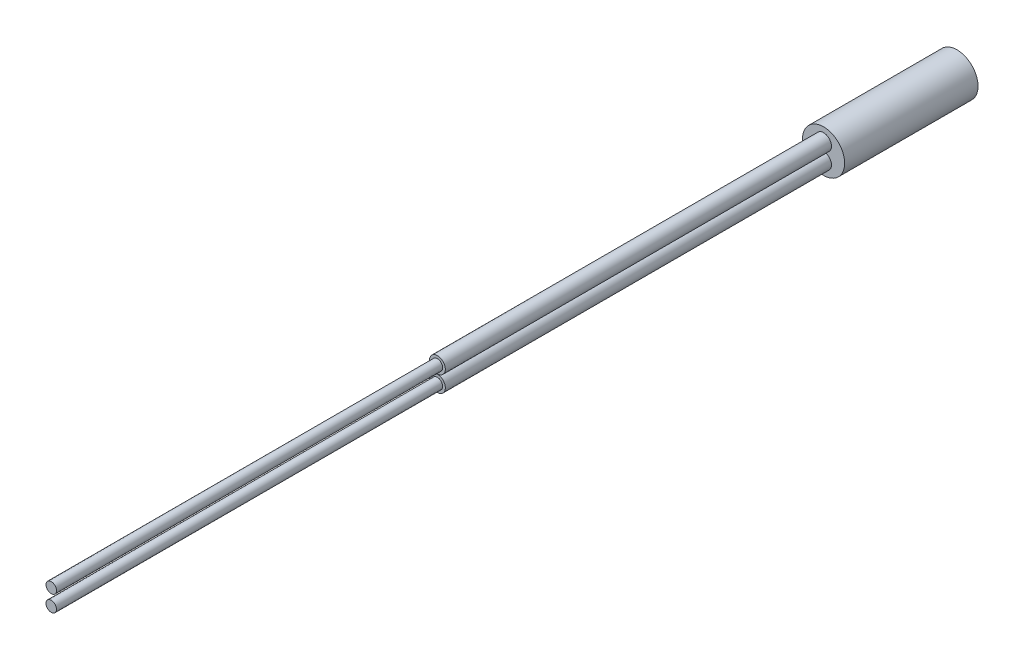
ISO-10303-21;
HEADER;
FILE_DESCRIPTION(('STEP AP214'),'2;1');
FILE_NAME('part.step','',(''),(''),'','','');
FILE_SCHEMA(('AUTOMOTIVE_DESIGN { 1 0 10303 214 1 1 1 1 }'));
ENDSEC;
DATA;
#1=APPLICATION_CONTEXT('core data for automotive mechanical design processes');
#2=APPLICATION_PROTOCOL_DEFINITION('international standard','automotive_design',2000,#1);
#3=PRODUCT_CONTEXT('',#1,'mechanical');
#4=PRODUCT('Part','Part','',(#3));
#5=PRODUCT_RELATED_PRODUCT_CATEGORY('part','',(#4));
#6=PRODUCT_DEFINITION_FORMATION('','',#4);
#7=PRODUCT_DEFINITION_CONTEXT('part definition',#1,'design');
#8=PRODUCT_DEFINITION('design','',#6,#7);
#9=PRODUCT_DEFINITION_SHAPE('','',#8);
#10=(LENGTH_UNIT() NAMED_UNIT(*) SI_UNIT(.MILLI.,.METRE.));
#11=(NAMED_UNIT(*) PLANE_ANGLE_UNIT() SI_UNIT($,.RADIAN.));
#12=(NAMED_UNIT(*) SI_UNIT($,.STERADIAN.) SOLID_ANGLE_UNIT());
#13=UNCERTAINTY_MEASURE_WITH_UNIT(LENGTH_MEASURE(1.E-05),#10,'distance_accuracy_value','');
#14=(GEOMETRIC_REPRESENTATION_CONTEXT(3) GLOBAL_UNCERTAINTY_ASSIGNED_CONTEXT((#13)) GLOBAL_UNIT_ASSIGNED_CONTEXT((#10,
#11,#12)) REPRESENTATION_CONTEXT('',''));
#15=CARTESIAN_POINT('',(0.,0.,0.));
#16=DIRECTION('',(0.,0.,1.));
#17=DIRECTION('',(1.,0.,0.));
#18=AXIS2_PLACEMENT_3D('',#15,#16,#17);
#19=CARTESIAN_POINT('',(0.,1.15,76.5));
#20=DIRECTION('',(0.,0.,1.));
#21=DIRECTION('',(1.,0.,0.));
#22=AXIS2_PLACEMENT_3D('',#19,#20,#21);
#23=PLANE('',#22);
#24=CARTESIAN_POINT('',(0.,1.15,76.5));
#25=DIRECTION('',(0.,0.,1.));
#26=DIRECTION('',(1.,0.,0.));
#27=AXIS2_PLACEMENT_3D('',#24,#25,#26);
#28=CIRCLE('',#27,1.125);
#29=CARTESIAN_POINT('',(1.125,1.15,76.5));
#30=VERTEX_POINT('',#29);
#31=EDGE_CURVE('E55',#30,#30,#28,.T.);
#32=ORIENTED_EDGE('',*,*,#31,.T.);
#33=EDGE_LOOP('',(#32));
#34=FACE_BOUND('',#33,.T.);
#35=CARTESIAN_POINT('',(0.,1.15,76.5));
#36=DIRECTION('',(0.,0.,1.));
#37=DIRECTION('',(1.,0.,0.));
#38=AXIS2_PLACEMENT_3D('',#35,#36,#37);
#39=CIRCLE('',#38,0.75);
#40=CARTESIAN_POINT('',(0.75,1.15,76.5));
#41=VERTEX_POINT('',#40);
#42=EDGE_CURVE('E36',#41,#41,#39,.F.);
#43=ORIENTED_EDGE('',*,*,#42,.T.);
#44=EDGE_LOOP('',(#43));
#45=FACE_BOUND('',#44,.T.);
#46=ADVANCED_FACE('F32',(#34,#45),#23,.T.);
#47=CARTESIAN_POINT('',(0.,-1.15,76.5));
#48=DIRECTION('',(0.,0.,1.));
#49=DIRECTION('',(1.,0.,0.));
#50=AXIS2_PLACEMENT_3D('',#47,#48,#49);
#51=PLANE('',#50);
#52=CARTESIAN_POINT('',(0.,-1.15,76.5));
#53=DIRECTION('',(0.,0.,1.));
#54=DIRECTION('',(1.,0.,0.));
#55=AXIS2_PLACEMENT_3D('',#52,#53,#54);
#56=CIRCLE('',#55,1.125);
#57=CARTESIAN_POINT('',(1.125,-1.15,76.5));
#58=VERTEX_POINT('',#57);
#59=EDGE_CURVE('E45',#58,#58,#56,.T.);
#60=ORIENTED_EDGE('',*,*,#59,.T.);
#61=EDGE_LOOP('',(#60));
#62=FACE_BOUND('',#61,.T.);
#63=CARTESIAN_POINT('',(0.,-1.15,76.5));
#64=DIRECTION('',(0.,0.,1.));
#65=DIRECTION('',(1.,0.,0.));
#66=AXIS2_PLACEMENT_3D('',#63,#64,#65);
#67=CIRCLE('',#66,0.75);
#68=CARTESIAN_POINT('',(0.75,-1.15,76.5));
#69=VERTEX_POINT('',#68);
#70=EDGE_CURVE('E48',#69,#69,#67,.F.);
#71=ORIENTED_EDGE('',*,*,#70,.T.);
#72=EDGE_LOOP('',(#71));
#73=FACE_BOUND('',#72,.T.);
#74=ADVANCED_FACE('F76',(#62,#73),#51,.T.);
#75=CARTESIAN_POINT('',(0.,0.,21.5));
#76=DIRECTION('',(0.,0.,1.));
#77=DIRECTION('',(1.,0.,0.));
#78=AXIS2_PLACEMENT_3D('',#75,#76,#77);
#79=PLANE('',#78);
#80=CARTESIAN_POINT('',(0.,-1.15,21.5));
#81=DIRECTION('',(0.,0.,1.));
#82=DIRECTION('',(1.,0.,0.));
#83=AXIS2_PLACEMENT_3D('',#80,#81,#82);
#84=CIRCLE('',#83,1.125);
#85=CARTESIAN_POINT('',(1.125,-1.15,21.5));
#86=VERTEX_POINT('',#85);
#87=EDGE_CURVE('E66',#86,#86,#84,.T.);
#88=ORIENTED_EDGE('',*,*,#87,.F.);
#89=EDGE_LOOP('',(#88));
#90=FACE_BOUND('',#89,.T.);
#91=CARTESIAN_POINT('',(0.,0.,21.5));
#92=DIRECTION('',(0.,0.,1.));
#93=DIRECTION('',(1.,0.,0.));
#94=AXIS2_PLACEMENT_3D('',#91,#92,#93);
#95=CIRCLE('',#94,3.);
#96=CARTESIAN_POINT('',(3.,0.,21.5));
#97=VERTEX_POINT('',#96);
#98=EDGE_CURVE('E10',#97,#97,#95,.T.);
#99=ORIENTED_EDGE('',*,*,#98,.T.);
#100=EDGE_LOOP('',(#99));
#101=FACE_BOUND('',#100,.T.);
#102=CARTESIAN_POINT('',(0.,1.15,21.5));
#103=DIRECTION('',(0.,0.,1.));
#104=DIRECTION('',(1.,0.,0.));
#105=AXIS2_PLACEMENT_3D('',#102,#103,#104);
#106=CIRCLE('',#105,1.125);
#107=CARTESIAN_POINT('',(1.125,1.15,21.5));
#108=VERTEX_POINT('',#107);
#109=EDGE_CURVE('E50',#108,#108,#106,.T.);
#110=ORIENTED_EDGE('',*,*,#109,.F.);
#111=EDGE_LOOP('',(#110));
#112=FACE_BOUND('',#111,.T.);
#113=ADVANCED_FACE('F74',(#90,#101,#112),#79,.T.);
#114=CARTESIAN_POINT('',(0.,0.,18.));
#115=DIRECTION('',(0.,0.,-1.));
#116=DIRECTION('',(-1.,0.,0.));
#117=AXIS2_PLACEMENT_3D('',#114,#115,#116);
#118=CYLINDRICAL_SURFACE('',#117,3.);
#119=ORIENTED_EDGE('',*,*,#98,.F.);
#120=EDGE_LOOP('',(#119));
#121=FACE_BOUND('',#120,.T.);
#122=CARTESIAN_POINT('',(0.,0.,2.5));
#123=DIRECTION('',(0.,0.,-1.));
#124=DIRECTION('',(-1.,0.,0.));
#125=AXIS2_PLACEMENT_3D('',#122,#123,#124);
#126=CIRCLE('',#125,3.);
#127=CARTESIAN_POINT('',(-3.,0.,2.5));
#128=VERTEX_POINT('',#127);
#129=EDGE_CURVE('E40',#128,#128,#126,.T.);
#130=ORIENTED_EDGE('',*,*,#129,.F.);
#131=EDGE_LOOP('',(#130));
#132=FACE_BOUND('',#131,.T.);
#133=ADVANCED_FACE('F34',(#121,#132),#118,.T.);
#134=CARTESIAN_POINT('',(0.,0.,2.5));
#135=DIRECTION('',(0.,0.,-1.));
#136=DIRECTION('',(-1.,0.,0.));
#137=AXIS2_PLACEMENT_3D('',#134,#135,#136);
#138=PLANE('',#137);
#139=ORIENTED_EDGE('',*,*,#129,.T.);
#140=EDGE_LOOP('',(#139));
#141=FACE_BOUND('',#140,.T.);
#142=ADVANCED_FACE('F92',(#141),#138,.T.);
#143=CARTESIAN_POINT('',(0.,-1.15,76.5));
#144=DIRECTION('',(0.,0.,-1.));
#145=DIRECTION('',(-1.,0.,0.));
#146=AXIS2_PLACEMENT_3D('',#143,#144,#145);
#147=CYLINDRICAL_SURFACE('',#146,1.125);
#148=ORIENTED_EDGE('',*,*,#59,.F.);
#149=EDGE_LOOP('',(#148));
#150=FACE_BOUND('',#149,.T.);
#151=ORIENTED_EDGE('',*,*,#87,.T.);
#152=EDGE_LOOP('',(#151));
#153=FACE_BOUND('',#152,.T.);
#154=ADVANCED_FACE('F72',(#150,#153),#147,.T.);
#155=CARTESIAN_POINT('',(0.,1.15,76.5));
#156=DIRECTION('',(0.,0.,-1.));
#157=DIRECTION('',(-1.,0.,0.));
#158=AXIS2_PLACEMENT_3D('',#155,#156,#157);
#159=CYLINDRICAL_SURFACE('',#158,1.125);
#160=ORIENTED_EDGE('',*,*,#31,.F.);
#161=EDGE_LOOP('',(#160));
#162=FACE_BOUND('',#161,.T.);
#163=ORIENTED_EDGE('',*,*,#109,.T.);
#164=EDGE_LOOP('',(#163));
#165=FACE_BOUND('',#164,.T.);
#166=ADVANCED_FACE('F80',(#162,#165),#159,.T.);
#167=CARTESIAN_POINT('',(0.,-1.15,131.5));
#168=DIRECTION('',(0.,0.,-1.));
#169=DIRECTION('',(-1.,0.,0.));
#170=AXIS2_PLACEMENT_3D('',#167,#168,#169);
#171=CYLINDRICAL_SURFACE('',#170,0.75);
#172=ORIENTED_EDGE('',*,*,#70,.F.);
#173=EDGE_LOOP('',(#172));
#174=FACE_BOUND('',#173,.T.);
#175=CARTESIAN_POINT('',(0.,-1.15,131.5));
#176=DIRECTION('',(0.,0.,1.));
#177=DIRECTION('',(1.,0.,0.));
#178=AXIS2_PLACEMENT_3D('',#175,#176,#177);
#179=CIRCLE('',#178,0.75);
#180=CARTESIAN_POINT('',(0.75,-1.15,131.5));
#181=VERTEX_POINT('',#180);
#182=EDGE_CURVE('E51',#181,#181,#179,.T.);
#183=ORIENTED_EDGE('',*,*,#182,.F.);
#184=EDGE_LOOP('',(#183));
#185=FACE_BOUND('',#184,.T.);
#186=ADVANCED_FACE('F82',(#174,#185),#171,.T.);
#187=CARTESIAN_POINT('',(0.,-1.15,131.5));
#188=DIRECTION('',(0.,0.,1.));
#189=DIRECTION('',(1.,0.,0.));
#190=AXIS2_PLACEMENT_3D('',#187,#188,#189);
#191=PLANE('',#190);
#192=ORIENTED_EDGE('',*,*,#182,.T.);
#193=EDGE_LOOP('',(#192));
#194=FACE_BOUND('',#193,.T.);
#195=ADVANCED_FACE('F89',(#194),#191,.T.);
#196=CARTESIAN_POINT('',(0.,1.15,131.5));
#197=DIRECTION('',(0.,0.,-1.));
#198=DIRECTION('',(-1.,0.,0.));
#199=AXIS2_PLACEMENT_3D('',#196,#197,#198);
#200=CYLINDRICAL_SURFACE('',#199,0.75);
#201=ORIENTED_EDGE('',*,*,#42,.F.);
#202=EDGE_LOOP('',(#201));
#203=FACE_BOUND('',#202,.T.);
#204=CARTESIAN_POINT('',(0.,1.15,131.5));
#205=DIRECTION('',(0.,0.,1.));
#206=DIRECTION('',(1.,0.,0.));
#207=AXIS2_PLACEMENT_3D('',#204,#205,#206);
#208=CIRCLE('',#207,0.75);
#209=CARTESIAN_POINT('',(0.75,1.15,131.5));
#210=VERTEX_POINT('',#209);
#211=EDGE_CURVE('E62',#210,#210,#208,.T.);
#212=ORIENTED_EDGE('',*,*,#211,.F.);
#213=EDGE_LOOP('',(#212));
#214=FACE_BOUND('',#213,.T.);
#215=ADVANCED_FACE('F108',(#203,#214),#200,.T.);
#216=CARTESIAN_POINT('',(0.,1.15,131.5));
#217=DIRECTION('',(0.,0.,1.));
#218=DIRECTION('',(1.,0.,0.));
#219=AXIS2_PLACEMENT_3D('',#216,#217,#218);
#220=PLANE('',#219);
#221=ORIENTED_EDGE('',*,*,#211,.T.);
#222=EDGE_LOOP('',(#221));
#223=FACE_BOUND('',#222,.T.);
#224=ADVANCED_FACE('F111',(#223),#220,.T.);
#225=CLOSED_SHELL('',(#46,#74,#113,#133,#142,#154,#166,#186,#195,#215,#224));
#226=MANIFOLD_SOLID_BREP('B2',#225);
#227=ADVANCED_BREP_SHAPE_REPRESENTATION('',(#18,#226),#14);
#228=SHAPE_DEFINITION_REPRESENTATION(#9,#227);
ENDSEC;
END-ISO-10303-21;
